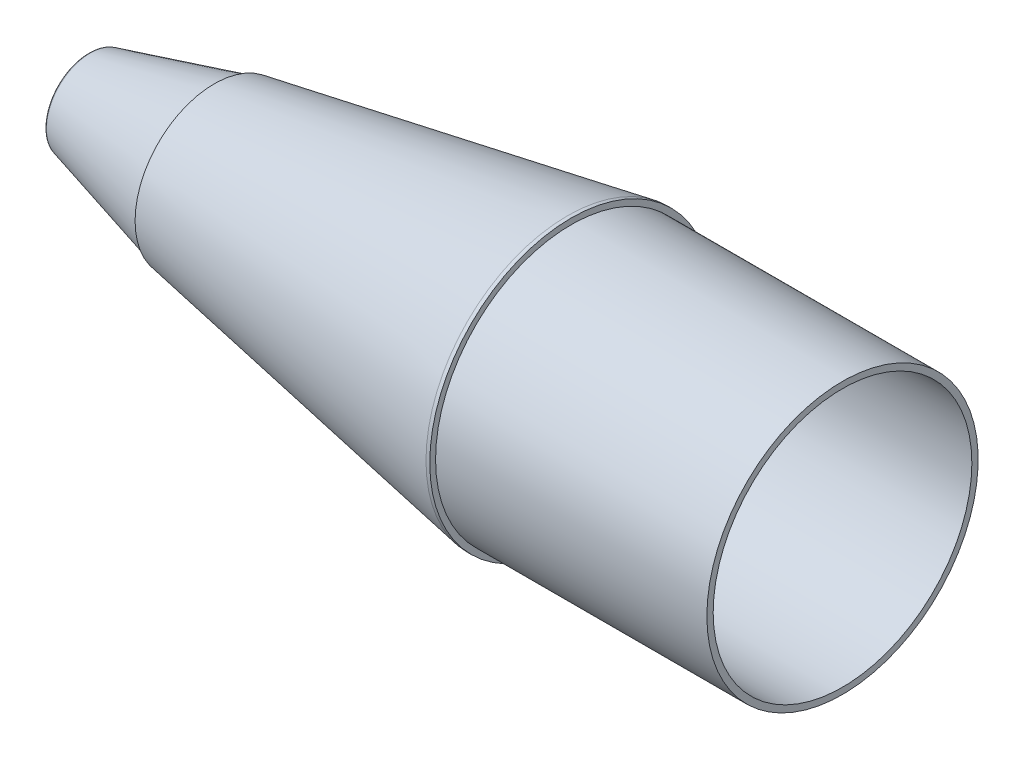
ISO-10303-21;
HEADER;
FILE_DESCRIPTION(('STEP AP214'),'2;1');
FILE_NAME('part.step','',(''),(''),'','','');
FILE_SCHEMA(('AUTOMOTIVE_DESIGN { 1 0 10303 214 1 1 1 1 }'));
ENDSEC;
DATA;
#1=APPLICATION_CONTEXT('core data for automotive mechanical design processes');
#2=APPLICATION_PROTOCOL_DEFINITION('international standard','automotive_design',2000,#1);
#3=PRODUCT_CONTEXT('',#1,'mechanical');
#4=PRODUCT('Part','Part','',(#3));
#5=PRODUCT_RELATED_PRODUCT_CATEGORY('part','',(#4));
#6=PRODUCT_DEFINITION_FORMATION('','',#4);
#7=PRODUCT_DEFINITION_CONTEXT('part definition',#1,'design');
#8=PRODUCT_DEFINITION('design','',#6,#7);
#9=PRODUCT_DEFINITION_SHAPE('','',#8);
#10=(LENGTH_UNIT() NAMED_UNIT(*) SI_UNIT(.MILLI.,.METRE.));
#11=(NAMED_UNIT(*) PLANE_ANGLE_UNIT() SI_UNIT($,.RADIAN.));
#12=(NAMED_UNIT(*) SI_UNIT($,.STERADIAN.) SOLID_ANGLE_UNIT());
#13=UNCERTAINTY_MEASURE_WITH_UNIT(LENGTH_MEASURE(1.E-05),#10,'distance_accuracy_value','');
#14=(GEOMETRIC_REPRESENTATION_CONTEXT(3) GLOBAL_UNCERTAINTY_ASSIGNED_CONTEXT((#13)) GLOBAL_UNIT_ASSIGNED_CONTEXT((#10,
#11,#12)) REPRESENTATION_CONTEXT('',''));
#15=CARTESIAN_POINT('',(0.,0.,0.));
#16=DIRECTION('',(0.,0.,1.));
#17=DIRECTION('',(1.,0.,0.));
#18=AXIS2_PLACEMENT_3D('',#15,#16,#17);
#19=CARTESIAN_POINT('',(0.,0.,0.));
#20=DIRECTION('',(1.,0.,0.));
#21=DIRECTION('',(0.,0.,-1.));
#22=AXIS2_PLACEMENT_3D('',#19,#20,#21);
#23=PLANE('',#22);
#24=CARTESIAN_POINT('',(0.,0.,0.));
#25=DIRECTION('',(1.,0.,0.));
#26=DIRECTION('',(0.,0.,-1.));
#27=AXIS2_PLACEMENT_3D('',#24,#25,#26);
#28=CIRCLE('',#27,8.34779789010669);
#29=CARTESIAN_POINT('',(0.,0.,-8.34779789010669));
#30=VERTEX_POINT('',#29);
#31=EDGE_CURVE('E61',#30,#30,#28,.F.);
#32=ORIENTED_EDGE('',*,*,#31,.T.);
#33=EDGE_LOOP('',(#32));
#34=FACE_BOUND('',#33,.T.);
#35=CARTESIAN_POINT('',(0.,0.,0.));
#36=DIRECTION('',(1.,0.,0.));
#37=DIRECTION('',(0.,0.,-1.));
#38=AXIS2_PLACEMENT_3D('',#35,#36,#37);
#39=CIRCLE('',#38,8.0264);
#40=CARTESIAN_POINT('',(0.,0.,-8.0264));
#41=VERTEX_POINT('',#40);
#42=EDGE_CURVE('E68',#41,#41,#39,.T.);
#43=ORIENTED_EDGE('',*,*,#42,.T.);
#44=EDGE_LOOP('',(#43));
#45=FACE_BOUND('',#44,.T.);
#46=ADVANCED_FACE('F43',(#34,#45),#23,.F.);
#47=CARTESIAN_POINT('',(0.,0.,0.));
#48=DIRECTION('',(1.,0.,0.));
#49=DIRECTION('',(0.,0.,1.));
#50=AXIS2_PLACEMENT_3D('',#47,#48,#49);
#51=CONICAL_SURFACE('',#50,7.366,0.26179938779915);
#52=CARTESIAN_POINT('',(23.810259962544,0.,0.));
#53=DIRECTION('',(-1.,0.,0.));
#54=DIRECTION('',(0.,0.,1.));
#55=AXIS2_PLACEMENT_3D('',#52,#53,#54);
#56=CIRCLE('',#55,13.7459399285388);
#57=CARTESIAN_POINT('',(23.810259962544,0.,13.7459399285388));
#58=VERTEX_POINT('',#57);
#59=EDGE_CURVE('E10',#58,#58,#56,.F.);
#60=ORIENTED_EDGE('',*,*,#59,.T.);
#61=EDGE_LOOP('',(#60));
#62=FACE_BOUND('',#61,.T.);
#63=CARTESIAN_POINT('',(2.46464635331848,0.,0.));
#64=DIRECTION('',(1.,0.,0.));
#65=DIRECTION('',(0.,0.,-1.));
#66=AXIS2_PLACEMENT_3D('',#63,#64,#65);
#67=CIRCLE('',#66,8.0264);
#68=CARTESIAN_POINT('',(2.46464635331848,0.,-8.0264));
#69=VERTEX_POINT('',#68);
#70=EDGE_CURVE('E119',#69,#69,#67,.F.);
#71=ORIENTED_EDGE('',*,*,#70,.T.);
#72=EDGE_LOOP('',(#71));
#73=FACE_BOUND('',#72,.T.);
#74=ADVANCED_FACE('F124',(#62,#73),#51,.F.);
#75=CARTESIAN_POINT('',(27.94,0.,0.));
#76=DIRECTION('',(1.,0.,0.));
#77=DIRECTION('',(0.,0.,-1.));
#78=AXIS2_PLACEMENT_3D('',#75,#76,#77);
#79=CYLINDRICAL_SURFACE('',#78,3.2639);
#80=CARTESIAN_POINT('',(27.94,0.,0.));
#81=DIRECTION('',(1.,0.,0.));
#82=DIRECTION('',(0.,0.,-1.));
#83=AXIS2_PLACEMENT_3D('',#80,#81,#82);
#84=CIRCLE('',#83,3.2639);
#85=CARTESIAN_POINT('',(27.94,0.,-3.2639));
#86=VERTEX_POINT('',#85);
#87=EDGE_CURVE('E67',#86,#86,#84,.T.);
#88=ORIENTED_EDGE('',*,*,#87,.T.);
#89=EDGE_LOOP('',(#88));
#90=FACE_BOUND('',#89,.T.);
#91=CARTESIAN_POINT('',(24.13,0.,0.));
#92=DIRECTION('',(-1.,0.,0.));
#93=DIRECTION('',(0.,0.,1.));
#94=AXIS2_PLACEMENT_3D('',#91,#92,#93);
#95=CIRCLE('',#94,3.2639);
#96=CARTESIAN_POINT('',(24.13,0.,3.2639));
#97=VERTEX_POINT('',#96);
#98=EDGE_CURVE('E64',#97,#97,#95,.F.);
#99=ORIENTED_EDGE('',*,*,#98,.F.);
#100=EDGE_LOOP('',(#99));
#101=FACE_BOUND('',#100,.T.);
#102=ADVANCED_FACE('F143',(#90,#101),#79,.F.);
#103=CARTESIAN_POINT('',(25.3100221667713,0.,0.));
#104=DIRECTION('',(1.,0.,0.));
#105=DIRECTION('',(0.,0.,-1.));
#106=AXIS2_PLACEMENT_3D('',#103,#104,#105);
#107=CONICAL_SURFACE('',#106,15.5194,0.261799387799143);
#108=CARTESIAN_POINT('',(0.376519925087922,0.,0.));
#109=DIRECTION('',(-1.,0.,0.));
#110=DIRECTION('',(0.,0.,1.));
#111=AXIS2_PLACEMENT_3D('',#108,#109,#110);
#112=CIRCLE('',#111,8.83848820986153);
#113=CARTESIAN_POINT('',(0.376519925087922,0.,8.83848820986153));
#114=VERTEX_POINT('',#113);
#115=EDGE_CURVE('E56',#114,#114,#112,.F.);
#116=ORIENTED_EDGE('',*,*,#115,.T.);
#117=EDGE_LOOP('',(#116));
#118=FACE_BOUND('',#117,.T.);
#119=CARTESIAN_POINT('',(25.3100221667713,0.,0.));
#120=DIRECTION('',(-1.,0.,0.));
#121=DIRECTION('',(0.,0.,1.));
#122=AXIS2_PLACEMENT_3D('',#119,#120,#121);
#123=CIRCLE('',#122,15.5194);
#124=CARTESIAN_POINT('',(25.3100221667713,0.,15.5194));
#125=VERTEX_POINT('',#124);
#126=EDGE_CURVE('E81',#125,#125,#123,.T.);
#127=ORIENTED_EDGE('',*,*,#126,.T.);
#128=EDGE_LOOP('',(#127));
#129=FACE_BOUND('',#128,.T.);
#130=ADVANCED_FACE('F184',(#118,#129),#107,.T.);
#131=CARTESIAN_POINT('',(25.3100221667713,15.9385,0.));
#132=DIRECTION('',(1.,0.,0.));
#133=DIRECTION('',(0.,0.,-1.));
#134=AXIS2_PLACEMENT_3D('',#131,#132,#133);
#135=PLANE('',#134);
#136=ORIENTED_EDGE('',*,*,#126,.F.);
#137=EDGE_LOOP('',(#136));
#138=FACE_BOUND('',#137,.T.);
#139=CARTESIAN_POINT('',(25.3100221667713,0.,0.));
#140=DIRECTION('',(-1.,0.,0.));
#141=DIRECTION('',(0.,0.,1.));
#142=AXIS2_PLACEMENT_3D('',#139,#140,#141);
#143=CIRCLE('',#142,15.9385);
#144=CARTESIAN_POINT('',(25.3100221667713,0.,15.9385));
#145=VERTEX_POINT('',#144);
#146=EDGE_CURVE('E85',#145,#145,#143,.T.);
#147=ORIENTED_EDGE('',*,*,#146,.T.);
#148=EDGE_LOOP('',(#147));
#149=FACE_BOUND('',#148,.T.);
#150=ADVANCED_FACE('F180',(#138,#149),#135,.F.);
#151=CARTESIAN_POINT('',(96.3989726474969,0.,0.));
#152=DIRECTION('',(1.,0.,0.));
#153=DIRECTION('',(0.,0.,-1.));
#154=AXIS2_PLACEMENT_3D('',#151,#152,#153);
#155=CONICAL_SURFACE('',#154,28.4734,0.174532925199434);
#156=ORIENTED_EDGE('',*,*,#146,.F.);
#157=EDGE_LOOP('',(#156));
#158=FACE_BOUND('',#157,.T.);
#159=CARTESIAN_POINT('',(96.3989726474969,0.,0.));
#160=DIRECTION('',(-1.,0.,0.));
#161=DIRECTION('',(0.,0.,1.));
#162=AXIS2_PLACEMENT_3D('',#159,#160,#161);
#163=CIRCLE('',#162,28.4734);
#164=CARTESIAN_POINT('',(96.3989726474969,0.,28.4734));
#165=VERTEX_POINT('',#164);
#166=EDGE_CURVE('E89',#165,#165,#163,.T.);
#167=ORIENTED_EDGE('',*,*,#166,.T.);
#168=EDGE_LOOP('',(#167));
#169=FACE_BOUND('',#168,.T.);
#170=ADVANCED_FACE('F176',(#158,#169),#155,.T.);
#171=CARTESIAN_POINT('',(0.,0.,0.));
#172=DIRECTION('',(-1.,0.,0.));
#173=DIRECTION('',(0.,0.,1.));
#174=AXIS2_PLACEMENT_3D('',#171,#172,#173);
#175=CYLINDRICAL_SURFACE('',#174,28.4734);
#176=ORIENTED_EDGE('',*,*,#166,.F.);
#177=EDGE_LOOP('',(#176));
#178=FACE_BOUND('',#177,.T.);
#179=CARTESIAN_POINT('',(97.1609726474969,0.,0.));
#180=DIRECTION('',(-1.,0.,0.));
#181=DIRECTION('',(0.,0.,1.));
#182=AXIS2_PLACEMENT_3D('',#179,#180,#181);
#183=CIRCLE('',#182,28.4734);
#184=CARTESIAN_POINT('',(97.1609726474969,0.,28.4734));
#185=VERTEX_POINT('',#184);
#186=EDGE_CURVE('E93',#185,#185,#183,.T.);
#187=ORIENTED_EDGE('',*,*,#186,.T.);
#188=EDGE_LOOP('',(#187));
#189=FACE_BOUND('',#188,.T.);
#190=ADVANCED_FACE('F172',(#178,#189),#175,.T.);
#191=CARTESIAN_POINT('',(97.1609726474969,28.4734,0.));
#192=DIRECTION('',(-1.,0.,0.));
#193=DIRECTION('',(0.,0.,1.));
#194=AXIS2_PLACEMENT_3D('',#191,#192,#193);
#195=PLANE('',#194);
#196=ORIENTED_EDGE('',*,*,#186,.F.);
#197=EDGE_LOOP('',(#196));
#198=FACE_BOUND('',#197,.T.);
#199=CARTESIAN_POINT('',(97.1609726474969,0.,0.));
#200=DIRECTION('',(-1.,0.,0.));
#201=DIRECTION('',(0.,0.,1.));
#202=AXIS2_PLACEMENT_3D('',#199,#200,#201);
#203=CIRCLE('',#202,27.305);
#204=CARTESIAN_POINT('',(97.1609726474969,0.,27.305));
#205=VERTEX_POINT('',#204);
#206=EDGE_CURVE('E97',#205,#205,#203,.T.);
#207=ORIENTED_EDGE('',*,*,#206,.T.);
#208=EDGE_LOOP('',(#207));
#209=FACE_BOUND('',#208,.T.);
#210=ADVANCED_FACE('F168',(#198,#209),#195,.F.);
#211=CARTESIAN_POINT('',(0.,0.,0.));
#212=DIRECTION('',(-1.,0.,0.));
#213=DIRECTION('',(0.,0.,1.));
#214=AXIS2_PLACEMENT_3D('',#211,#212,#213);
#215=CYLINDRICAL_SURFACE('',#214,27.305);
#216=ORIENTED_EDGE('',*,*,#206,.F.);
#217=EDGE_LOOP('',(#216));
#218=FACE_BOUND('',#217,.T.);
#219=CARTESIAN_POINT('',(151.770972647497,0.,0.));
#220=DIRECTION('',(-1.,0.,0.));
#221=DIRECTION('',(0.,0.,1.));
#222=AXIS2_PLACEMENT_3D('',#219,#220,#221);
#223=CIRCLE('',#222,27.305);
#224=CARTESIAN_POINT('',(151.770972647497,0.,27.305));
#225=VERTEX_POINT('',#224);
#226=EDGE_CURVE('E101',#225,#225,#223,.T.);
#227=ORIENTED_EDGE('',*,*,#226,.T.);
#228=EDGE_LOOP('',(#227));
#229=FACE_BOUND('',#228,.T.);
#230=ADVANCED_FACE('F164',(#218,#229),#215,.T.);
#231=CARTESIAN_POINT('',(151.770972647497,27.305,0.));
#232=DIRECTION('',(-1.,0.,0.));
#233=DIRECTION('',(0.,0.,1.));
#234=AXIS2_PLACEMENT_3D('',#231,#232,#233);
#235=PLANE('',#234);
#236=ORIENTED_EDGE('',*,*,#226,.F.);
#237=EDGE_LOOP('',(#236));
#238=FACE_BOUND('',#237,.T.);
#239=CARTESIAN_POINT('',(151.770972647497,0.,0.));
#240=DIRECTION('',(-1.,0.,0.));
#241=DIRECTION('',(0.,0.,1.));
#242=AXIS2_PLACEMENT_3D('',#239,#240,#241);
#243=CIRCLE('',#242,26.035);
#244=CARTESIAN_POINT('',(151.770972647497,0.,26.035));
#245=VERTEX_POINT('',#244);
#246=EDGE_CURVE('E105',#245,#245,#243,.T.);
#247=ORIENTED_EDGE('',*,*,#246,.T.);
#248=EDGE_LOOP('',(#247));
#249=FACE_BOUND('',#248,.T.);
#250=ADVANCED_FACE('F160',(#238,#249),#235,.F.);
#251=CARTESIAN_POINT('',(0.,0.,0.));
#252=DIRECTION('',(-1.,0.,0.));
#253=DIRECTION('',(0.,0.,1.));
#254=AXIS2_PLACEMENT_3D('',#251,#252,#253);
#255=CYLINDRICAL_SURFACE('',#254,26.035);
#256=ORIENTED_EDGE('',*,*,#246,.F.);
#257=EDGE_LOOP('',(#256));
#258=FACE_BOUND('',#257,.T.);
#259=CARTESIAN_POINT('',(91.346485274852,0.,0.));
#260=DIRECTION('',(-1.,0.,0.));
#261=DIRECTION('',(0.,0.,1.));
#262=AXIS2_PLACEMENT_3D('',#259,#260,#261);
#263=CIRCLE('',#262,26.035);
#264=CARTESIAN_POINT('',(91.346485274852,0.,26.035));
#265=VERTEX_POINT('',#264);
#266=EDGE_CURVE('E109',#265,#265,#263,.T.);
#267=ORIENTED_EDGE('',*,*,#266,.T.);
#268=EDGE_LOOP('',(#267));
#269=FACE_BOUND('',#268,.T.);
#270=ADVANCED_FACE('F156',(#258,#269),#255,.F.);
#271=CARTESIAN_POINT('',(27.94,0.,0.));
#272=DIRECTION('',(1.,0.,0.));
#273=DIRECTION('',(0.,0.,-1.));
#274=AXIS2_PLACEMENT_3D('',#271,#272,#273);
#275=CONICAL_SURFACE('',#274,14.8547258941495,0.174532925199434);
#276=CARTESIAN_POINT('',(29.2203495135229,0.,0.));
#277=DIRECTION('',(1.,0.,0.));
#278=DIRECTION('',(0.,0.,-1.));
#279=AXIS2_PLACEMENT_3D('',#276,#277,#278);
#280=CIRCLE('',#279,15.0804860581206);
#281=CARTESIAN_POINT('',(29.2203495135229,0.,-15.0804860581206));
#282=VERTEX_POINT('',#281);
#283=EDGE_CURVE('E77',#282,#282,#280,.F.);
#284=ORIENTED_EDGE('',*,*,#283,.T.);
#285=EDGE_LOOP('',(#284));
#286=FACE_BOUND('',#285,.T.);
#287=ORIENTED_EDGE('',*,*,#266,.F.);
#288=EDGE_LOOP('',(#287));
#289=FACE_BOUND('',#288,.T.);
#290=ADVANCED_FACE('F152',(#286,#289),#275,.F.);
#291=CARTESIAN_POINT('',(27.94,14.8547258941495,0.));
#292=DIRECTION('',(-1.,0.,0.));
#293=DIRECTION('',(0.,0.,1.));
#294=AXIS2_PLACEMENT_3D('',#291,#292,#293);
#295=PLANE('',#294);
#296=ORIENTED_EDGE('',*,*,#87,.F.);
#297=EDGE_LOOP('',(#296));
#298=FACE_BOUND('',#297,.T.);
#299=CARTESIAN_POINT('',(27.94,0.,0.));
#300=DIRECTION('',(-1.,0.,0.));
#301=DIRECTION('',(0.,0.,1.));
#302=AXIS2_PLACEMENT_3D('',#299,#300,#301);
#303=CIRCLE('',#302,13.5546249256035);
#304=CARTESIAN_POINT('',(27.94,0.,13.5546249256035));
#305=VERTEX_POINT('',#304);
#306=EDGE_CURVE('E73',#305,#305,#303,.F.);
#307=ORIENTED_EDGE('',*,*,#306,.T.);
#308=EDGE_LOOP('',(#307));
#309=FACE_BOUND('',#308,.T.);
#310=ADVANCED_FACE('F148',(#298,#309),#295,.F.);
#311=CARTESIAN_POINT('',(29.4894,0.,0.));
#312=DIRECTION('',(-1.,0.,0.));
#313=DIRECTION('',(0.,0.,1.));
#314=AXIS2_PLACEMENT_3D('',#311,#312,#313);
#315=TOROIDAL_SURFACE('',#314,13.5546249256035,1.5494);
#316=ORIENTED_EDGE('',*,*,#306,.F.);
#317=EDGE_LOOP('',(#316));
#318=FACE_BOUND('',#317,.T.);
#319=ORIENTED_EDGE('',*,*,#283,.F.);
#320=EDGE_LOOP('',(#319));
#321=FACE_BOUND('',#320,.T.);
#322=ADVANCED_FACE('F151',(#318,#321),#315,.F.);
#323=CARTESIAN_POINT('',(0.508000000000002,0.,0.));
#324=DIRECTION('',(1.,0.,0.));
#325=DIRECTION('',(0.,0.,-1.));
#326=AXIS2_PLACEMENT_3D('',#323,#324,#325);
#327=TOROIDAL_SURFACE('',#326,8.34779789010669,0.508);
#328=ORIENTED_EDGE('',*,*,#115,.F.);
#329=EDGE_LOOP('',(#328));
#330=FACE_BOUND('',#329,.T.);
#331=ORIENTED_EDGE('',*,*,#31,.F.);
#332=EDGE_LOOP('',(#331));
#333=FACE_BOUND('',#332,.T.);
#334=ADVANCED_FACE('F190',(#330,#333),#327,.T.);
#335=CARTESIAN_POINT('',(24.13,0.,0.));
#336=DIRECTION('',(-1.,0.,0.));
#337=DIRECTION('',(0.,0.,1.));
#338=AXIS2_PLACEMENT_3D('',#335,#336,#337);
#339=PLANE('',#338);
#340=CARTESIAN_POINT('',(24.13,0.,0.));
#341=DIRECTION('',(-1.,0.,0.));
#342=DIRECTION('',(0.,0.,1.));
#343=AXIS2_PLACEMENT_3D('',#340,#341,#342);
#344=CIRCLE('',#343,13.5005947686613);
#345=CARTESIAN_POINT('',(24.13,0.,13.5005947686613));
#346=VERTEX_POINT('',#345);
#347=EDGE_CURVE('E51',#346,#346,#344,.T.);
#348=ORIENTED_EDGE('',*,*,#347,.T.);
#349=EDGE_LOOP('',(#348));
#350=FACE_BOUND('',#349,.T.);
#351=ORIENTED_EDGE('',*,*,#98,.T.);
#352=EDGE_LOOP('',(#351));
#353=FACE_BOUND('',#352,.T.);
#354=ADVANCED_FACE('F133',(#350,#353),#339,.T.);
#355=CARTESIAN_POINT('',(23.876,0.,0.));
#356=DIRECTION('',(-1.,0.,0.));
#357=DIRECTION('',(0.,0.,1.));
#358=AXIS2_PLACEMENT_3D('',#355,#356,#357);
#359=TOROIDAL_SURFACE('',#358,13.5005947686613,0.254);
#360=ORIENTED_EDGE('',*,*,#59,.F.);
#361=EDGE_LOOP('',(#360));
#362=FACE_BOUND('',#361,.T.);
#363=ORIENTED_EDGE('',*,*,#347,.F.);
#364=EDGE_LOOP('',(#363));
#365=FACE_BOUND('',#364,.T.);
#366=ADVANCED_FACE('F45',(#362,#365),#359,.F.);
#367=CARTESIAN_POINT('',(151.771972647497,0.,0.));
#368=DIRECTION('',(-1.,0.,0.));
#369=DIRECTION('',(0.,0.,1.));
#370=AXIS2_PLACEMENT_3D('',#367,#368,#369);
#371=CYLINDRICAL_SURFACE('',#370,8.0264);
#372=ORIENTED_EDGE('',*,*,#42,.F.);
#373=EDGE_LOOP('',(#372));
#374=FACE_BOUND('',#373,.T.);
#375=ORIENTED_EDGE('',*,*,#70,.F.);
#376=EDGE_LOOP('',(#375));
#377=FACE_BOUND('',#376,.T.);
#378=ADVANCED_FACE('F126',(#374,#377),#371,.F.);
#379=CLOSED_SHELL('',(#46,#74,#102,#130,#150,#170,#190,#210,#230,#250,#270,#290,#310,#322,#334,
#354,#366,#378));
#380=MANIFOLD_SOLID_BREP('B2',#379);
#381=ADVANCED_BREP_SHAPE_REPRESENTATION('',(#18,#380),#14);
#382=SHAPE_DEFINITION_REPRESENTATION(#9,#381);
ENDSEC;
END-ISO-10303-21;
